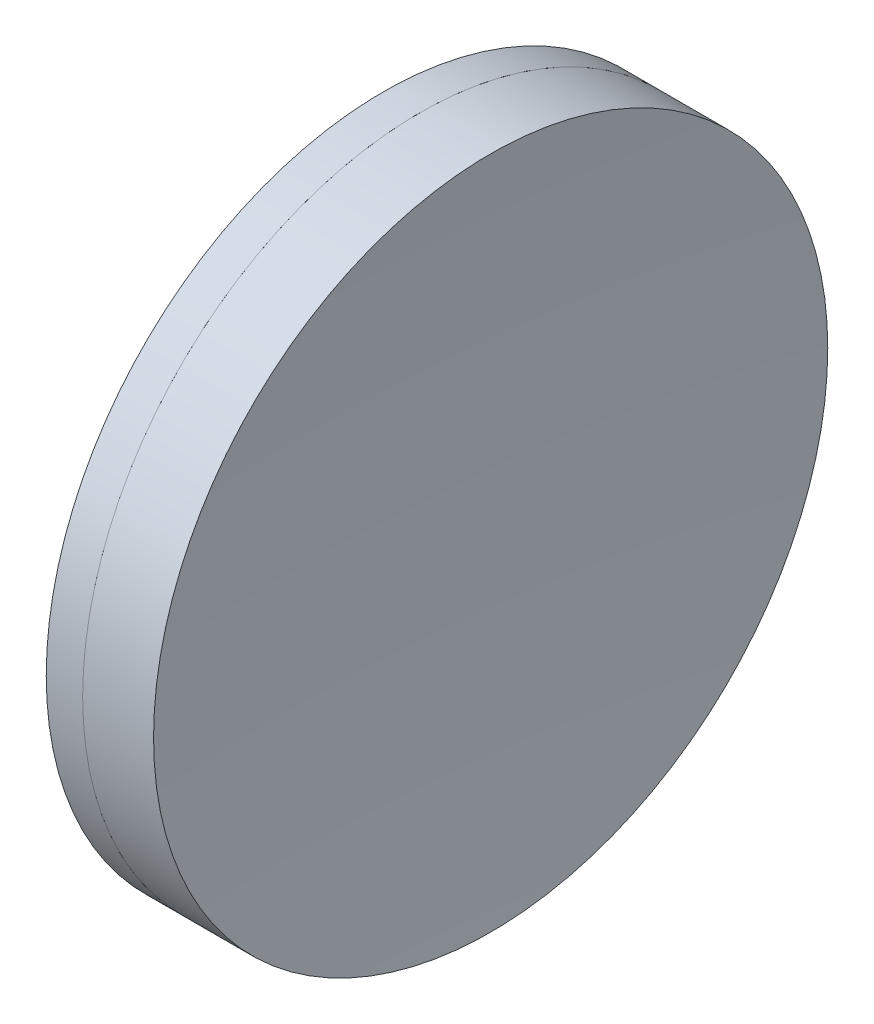
ISO-10303-21;
HEADER;
FILE_DESCRIPTION(('STEP AP214'),'2;1');
FILE_NAME('part.step','',(''),(''),'','','');
FILE_SCHEMA(('AUTOMOTIVE_DESIGN { 1 0 10303 214 1 1 1 1 }'));
ENDSEC;
DATA;
#1=APPLICATION_CONTEXT('core data for automotive mechanical design processes');
#2=APPLICATION_PROTOCOL_DEFINITION('international standard','automotive_design',2000,#1);
#3=PRODUCT_CONTEXT('',#1,'mechanical');
#4=PRODUCT('Part','Part','',(#3));
#5=PRODUCT_RELATED_PRODUCT_CATEGORY('part','',(#4));
#6=PRODUCT_DEFINITION_FORMATION('','',#4);
#7=PRODUCT_DEFINITION_CONTEXT('part definition',#1,'design');
#8=PRODUCT_DEFINITION('design','',#6,#7);
#9=PRODUCT_DEFINITION_SHAPE('','',#8);
#10=(LENGTH_UNIT() NAMED_UNIT(*) SI_UNIT(.MILLI.,.METRE.));
#11=(NAMED_UNIT(*) PLANE_ANGLE_UNIT() SI_UNIT($,.RADIAN.));
#12=(NAMED_UNIT(*) SI_UNIT($,.STERADIAN.) SOLID_ANGLE_UNIT());
#13=UNCERTAINTY_MEASURE_WITH_UNIT(LENGTH_MEASURE(1.E-05),#10,'distance_accuracy_value','');
#14=(GEOMETRIC_REPRESENTATION_CONTEXT(3) GLOBAL_UNCERTAINTY_ASSIGNED_CONTEXT((#13)) GLOBAL_UNIT_ASSIGNED_CONTEXT((#10,
#11,#12)) REPRESENTATION_CONTEXT('',''));
#15=CARTESIAN_POINT('',(0.,0.,0.));
#16=DIRECTION('',(0.,0.,1.));
#17=DIRECTION('',(1.,0.,0.));
#18=AXIS2_PLACEMENT_3D('',#15,#16,#17);
#19=CARTESIAN_POINT('',(86.3079002687381,0.,0.));
#20=DIRECTION('',(-1.,0.,0.));
#21=DIRECTION('',(0.,0.,-1.));
#22=AXIS2_PLACEMENT_3D('',#19,#20,#21);
#23=SPHERICAL_SURFACE('',#22,234.27);
#24=CARTESIAN_POINT('',(319.196871454581,0.,0.));
#25=DIRECTION('',(-1.,0.,0.));
#26=DIRECTION('',(0.,0.,1.));
#27=AXIS2_PLACEMENT_3D('',#24,#25,#26);
#28=CIRCLE('',#27,25.4);
#29=CARTESIAN_POINT('',(319.196871454581,0.,25.4));
#30=VERTEX_POINT('',#29);
#31=EDGE_CURVE('E51',#30,#30,#28,.T.);
#32=ORIENTED_EDGE('',*,*,#31,.T.);
#33=EDGE_LOOP('',(#32));
#34=FACE_BOUND('',#33,.T.);
#35=ADVANCED_FACE('F45',(#34),#23,.F.);
#36=CARTESIAN_POINT('',(659.577900268739,0.,0.));
#37=DIRECTION('',(-1.,0.,0.));
#38=DIRECTION('',(0.,0.,-1.));
#39=AXIS2_PLACEMENT_3D('',#36,#37,#38);
#40=SPHERICAL_SURFACE('',#39,336.);
#41=CARTESIAN_POINT('',(324.539335324343,0.,0.));
#42=DIRECTION('',(-1.,0.,0.));
#43=DIRECTION('',(0.,0.,1.));
#44=AXIS2_PLACEMENT_3D('',#41,#42,#43);
#45=CIRCLE('',#44,25.4);
#46=CARTESIAN_POINT('',(324.539335324343,0.,25.4));
#47=VERTEX_POINT('',#46);
#48=EDGE_CURVE('E11',#47,#47,#45,.T.);
#49=ORIENTED_EDGE('',*,*,#48,.F.);
#50=EDGE_LOOP('',(#49));
#51=FACE_BOUND('',#50,.T.);
#52=ADVANCED_FACE('F60',(#51),#40,.F.);
#53=CARTESIAN_POINT('',(-0.551919992657797,0.,0.));
#54=DIRECTION('',(-1.,0.,0.));
#55=DIRECTION('',(0.,0.,1.));
#56=AXIS2_PLACEMENT_3D('',#53,#54,#55);
#57=CYLINDRICAL_SURFACE('',#56,25.4);
#58=ORIENTED_EDGE('',*,*,#48,.T.);
#59=EDGE_LOOP('',(#58));
#60=FACE_BOUND('',#59,.T.);
#61=ORIENTED_EDGE('',*,*,#31,.F.);
#62=EDGE_LOOP('',(#61));
#63=FACE_BOUND('',#62,.T.);
#64=ADVANCED_FACE('F58',(#60,#63),#57,.T.);
#65=CLOSED_SHELL('',(#35,#52,#64));
#66=MANIFOLD_SOLID_BREP('B2',#65);
#67=CARTESIAN_POINT('',(487.557900268738,0.,0.));
#68=DIRECTION('',(-1.,0.,0.));
#69=DIRECTION('',(0.,0.,-1.));
#70=AXIS2_PLACEMENT_3D('',#67,#68,#69);
#71=SPHERICAL_SURFACE('',#70,172.98);
#72=CARTESIAN_POINT('',(316.452902095102,0.,0.));
#73=DIRECTION('',(-1.,0.,0.));
#74=DIRECTION('',(0.,0.,1.));
#75=AXIS2_PLACEMENT_3D('',#72,#73,#74);
#76=CIRCLE('',#75,25.4);
#77=CARTESIAN_POINT('',(316.452902095102,0.,25.4));
#78=VERTEX_POINT('',#77);
#79=EDGE_CURVE('E44',#78,#78,#76,.T.);
#80=ORIENTED_EDGE('',*,*,#79,.T.);
#81=EDGE_LOOP('',(#80));
#82=FACE_BOUND('',#81,.T.);
#83=ADVANCED_FACE('F86',(#82),#71,.T.);
#84=CARTESIAN_POINT('',(-0.816062176165804,0.,0.));
#85=DIRECTION('',(-1.,0.,0.));
#86=DIRECTION('',(0.,0.,1.));
#87=AXIS2_PLACEMENT_3D('',#84,#85,#86);
#88=CYLINDRICAL_SURFACE('',#87,25.4);
#89=CARTESIAN_POINT('',(319.196871454581,0.,0.));
#90=DIRECTION('',(-1.,0.,0.));
#91=DIRECTION('',(0.,0.,1.));
#92=AXIS2_PLACEMENT_3D('',#89,#90,#91);
#93=CIRCLE('',#92,25.4);
#94=CARTESIAN_POINT('',(319.196871454581,0.,25.4));
#95=VERTEX_POINT('',#94);
#96=EDGE_CURVE('E92',#95,#95,#93,.T.);
#97=ORIENTED_EDGE('',*,*,#96,.T.);
#98=EDGE_LOOP('',(#97));
#99=FACE_BOUND('',#98,.T.);
#100=ORIENTED_EDGE('',*,*,#79,.F.);
#101=EDGE_LOOP('',(#100));
#102=FACE_BOUND('',#101,.T.);
#103=ADVANCED_FACE('F98',(#99,#102),#88,.T.);
#104=CARTESIAN_POINT('',(86.3079002687381,0.,0.));
#105=DIRECTION('',(-1.,0.,0.));
#106=DIRECTION('',(0.,0.,1.));
#107=AXIS2_PLACEMENT_3D('',#104,#105,#106);
#108=SPHERICAL_SURFACE('',#107,234.27);
#109=ORIENTED_EDGE('',*,*,#96,.F.);
#110=EDGE_LOOP('',(#109));
#111=FACE_BOUND('',#110,.T.);
#112=ADVANCED_FACE('F101',(#111),#108,.T.);
#113=CLOSED_SHELL('',(#83,#103,#112));
#114=MANIFOLD_SOLID_BREP('B6',#113);
#115=ADVANCED_BREP_SHAPE_REPRESENTATION('',(#18,#66,#114),#14);
#116=SHAPE_DEFINITION_REPRESENTATION(#9,#115);
ENDSEC;
END-ISO-10303-21;
